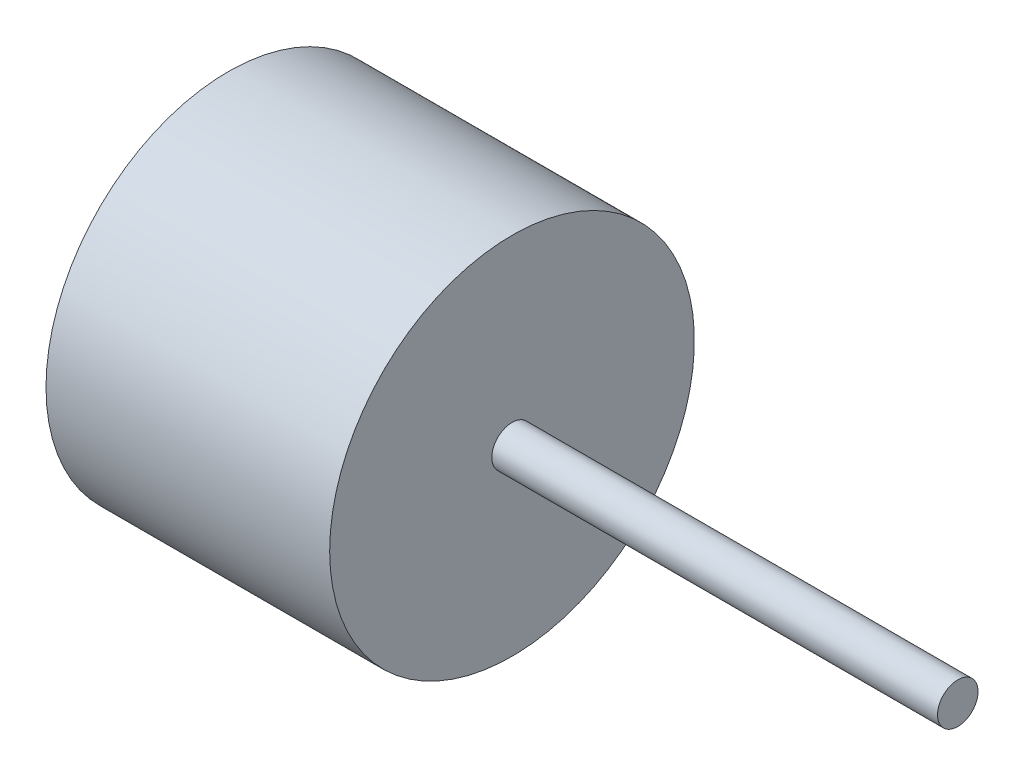
ISO-10303-21;
HEADER;
FILE_DESCRIPTION(('STEP AP214'),'2;1');
FILE_NAME('part.step','',(''),(''),'','','');
FILE_SCHEMA(('AUTOMOTIVE_DESIGN { 1 0 10303 214 1 1 1 1 }'));
ENDSEC;
DATA;
#1=APPLICATION_CONTEXT('core data for automotive mechanical design processes');
#2=APPLICATION_PROTOCOL_DEFINITION('international standard','automotive_design',2000,#1);
#3=PRODUCT_CONTEXT('',#1,'mechanical');
#4=PRODUCT('Part','Part','',(#3));
#5=PRODUCT_RELATED_PRODUCT_CATEGORY('part','',(#4));
#6=PRODUCT_DEFINITION_FORMATION('','',#4);
#7=PRODUCT_DEFINITION_CONTEXT('part definition',#1,'design');
#8=PRODUCT_DEFINITION('design','',#6,#7);
#9=PRODUCT_DEFINITION_SHAPE('','',#8);
#10=(LENGTH_UNIT() NAMED_UNIT(*) SI_UNIT(.MILLI.,.METRE.));
#11=(NAMED_UNIT(*) PLANE_ANGLE_UNIT() SI_UNIT($,.RADIAN.));
#12=(NAMED_UNIT(*) SI_UNIT($,.STERADIAN.) SOLID_ANGLE_UNIT());
#13=UNCERTAINTY_MEASURE_WITH_UNIT(LENGTH_MEASURE(1.E-05),#10,'distance_accuracy_value','');
#14=(GEOMETRIC_REPRESENTATION_CONTEXT(3) GLOBAL_UNCERTAINTY_ASSIGNED_CONTEXT((#13)) GLOBAL_UNIT_ASSIGNED_CONTEXT((#10,
#11,#12)) REPRESENTATION_CONTEXT('',''));
#15=CARTESIAN_POINT('',(0.,0.,0.));
#16=DIRECTION('',(0.,0.,1.));
#17=DIRECTION('',(1.,0.,0.));
#18=AXIS2_PLACEMENT_3D('',#15,#16,#17);
#19=CARTESIAN_POINT('',(22.,0.,0.));
#20=DIRECTION('',(-1.,0.,0.));
#21=DIRECTION('',(0.,0.,1.));
#22=AXIS2_PLACEMENT_3D('',#19,#20,#21);
#23=PLANE('',#22);
#24=CARTESIAN_POINT('',(22.,0.,0.));
#25=DIRECTION('',(-1.,0.,0.));
#26=DIRECTION('',(0.,0.,1.));
#27=AXIS2_PLACEMENT_3D('',#24,#25,#26);
#28=CIRCLE('',#27,1.);
#29=CARTESIAN_POINT('',(22.,0.,1.));
#30=VERTEX_POINT('',#29);
#31=EDGE_CURVE('E10',#30,#30,#28,.T.);
#32=ORIENTED_EDGE('',*,*,#31,.F.);
#33=EDGE_LOOP('',(#32));
#34=FACE_BOUND('',#33,.T.);
#35=ADVANCED_FACE('F30',(#34),#23,.F.);
#36=CARTESIAN_POINT('',(-38.2150595238095,0.,0.));
#37=DIRECTION('',(-1.,0.,0.));
#38=DIRECTION('',(0.,0.,1.));
#39=AXIS2_PLACEMENT_3D('',#36,#37,#38);
#40=CYLINDRICAL_SURFACE('',#39,1.);
#41=CARTESIAN_POINT('',(0.,0.,0.));
#42=DIRECTION('',(-1.,0.,0.));
#43=DIRECTION('',(0.,0.,1.));
#44=AXIS2_PLACEMENT_3D('',#41,#42,#43);
#45=CIRCLE('',#44,1.);
#46=CARTESIAN_POINT('',(0.,0.,1.));
#47=VERTEX_POINT('',#46);
#48=EDGE_CURVE('E36',#47,#47,#45,.T.);
#49=ORIENTED_EDGE('',*,*,#48,.F.);
#50=EDGE_LOOP('',(#49));
#51=FACE_BOUND('',#50,.T.);
#52=ORIENTED_EDGE('',*,*,#31,.T.);
#53=EDGE_LOOP('',(#52));
#54=FACE_BOUND('',#53,.T.);
#55=ADVANCED_FACE('F60',(#51,#54),#40,.T.);
#56=CARTESIAN_POINT('',(0.,1.,0.));
#57=DIRECTION('',(-1.,0.,0.));
#58=DIRECTION('',(0.,0.,1.));
#59=AXIS2_PLACEMENT_3D('',#56,#57,#58);
#60=PLANE('',#59);
#61=CARTESIAN_POINT('',(0.,0.,0.));
#62=DIRECTION('',(-1.,0.,0.));
#63=DIRECTION('',(0.,0.,1.));
#64=AXIS2_PLACEMENT_3D('',#61,#62,#63);
#65=CIRCLE('',#64,9.);
#66=CARTESIAN_POINT('',(0.,0.,9.));
#67=VERTEX_POINT('',#66);
#68=EDGE_CURVE('E40',#67,#67,#65,.T.);
#69=ORIENTED_EDGE('',*,*,#68,.F.);
#70=EDGE_LOOP('',(#69));
#71=FACE_BOUND('',#70,.T.);
#72=ORIENTED_EDGE('',*,*,#48,.T.);
#73=EDGE_LOOP('',(#72));
#74=FACE_BOUND('',#73,.T.);
#75=ADVANCED_FACE('F55',(#71,#74),#60,.F.);
#76=CARTESIAN_POINT('',(-38.2150595238095,0.,0.));
#77=DIRECTION('',(-1.,0.,0.));
#78=DIRECTION('',(0.,0.,1.));
#79=AXIS2_PLACEMENT_3D('',#76,#77,#78);
#80=CYLINDRICAL_SURFACE('',#79,9.);
#81=CARTESIAN_POINT('',(-14.,0.,0.));
#82=DIRECTION('',(-1.,0.,0.));
#83=DIRECTION('',(0.,0.,1.));
#84=AXIS2_PLACEMENT_3D('',#81,#82,#83);
#85=CIRCLE('',#84,9.);
#86=CARTESIAN_POINT('',(-14.,0.,9.));
#87=VERTEX_POINT('',#86);
#88=EDGE_CURVE('E44',#87,#87,#85,.T.);
#89=ORIENTED_EDGE('',*,*,#88,.F.);
#90=EDGE_LOOP('',(#89));
#91=FACE_BOUND('',#90,.T.);
#92=ORIENTED_EDGE('',*,*,#68,.T.);
#93=EDGE_LOOP('',(#92));
#94=FACE_BOUND('',#93,.T.);
#95=ADVANCED_FACE('F52',(#91,#94),#80,.T.);
#96=CARTESIAN_POINT('',(-14.,9.,0.));
#97=DIRECTION('',(1.,0.,0.));
#98=DIRECTION('',(0.,0.,-1.));
#99=AXIS2_PLACEMENT_3D('',#96,#97,#98);
#100=PLANE('',#99);
#101=ORIENTED_EDGE('',*,*,#88,.T.);
#102=EDGE_LOOP('',(#101));
#103=FACE_BOUND('',#102,.T.);
#104=ADVANCED_FACE('F50',(#103),#100,.F.);
#105=CLOSED_SHELL('',(#35,#55,#75,#95,#104));
#106=MANIFOLD_SOLID_BREP('B2',#105);
#107=ADVANCED_BREP_SHAPE_REPRESENTATION('',(#18,#106),#14);
#108=SHAPE_DEFINITION_REPRESENTATION(#9,#107);
ENDSEC;
END-ISO-10303-21;
